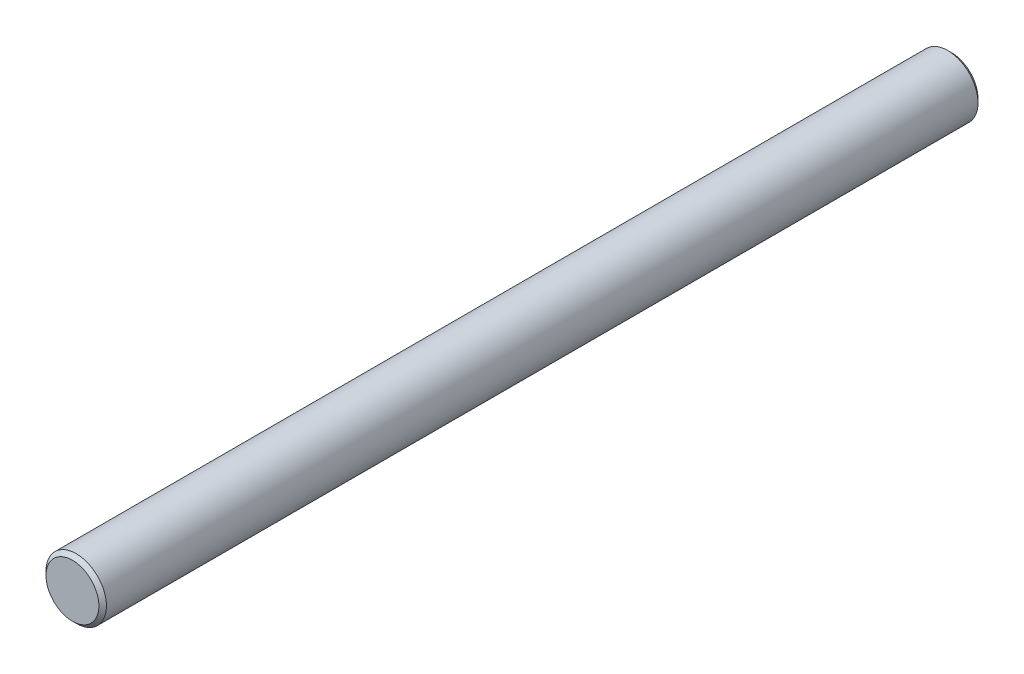
ISO-10303-21;
HEADER;
FILE_DESCRIPTION(('STEP AP214'),'2;1');
FILE_NAME('part.step','',(''),(''),'','','');
FILE_SCHEMA(('AUTOMOTIVE_DESIGN { 1 0 10303 214 1 1 1 1 }'));
ENDSEC;
DATA;
#1=APPLICATION_CONTEXT('core data for automotive mechanical design processes');
#2=APPLICATION_PROTOCOL_DEFINITION('international standard','automotive_design',2000,#1);
#3=PRODUCT_CONTEXT('',#1,'mechanical');
#4=PRODUCT('Part','Part','',(#3));
#5=PRODUCT_RELATED_PRODUCT_CATEGORY('part','',(#4));
#6=PRODUCT_DEFINITION_FORMATION('','',#4);
#7=PRODUCT_DEFINITION_CONTEXT('part definition',#1,'design');
#8=PRODUCT_DEFINITION('design','',#6,#7);
#9=PRODUCT_DEFINITION_SHAPE('','',#8);
#10=(LENGTH_UNIT() NAMED_UNIT(*) SI_UNIT(.MILLI.,.METRE.));
#11=(NAMED_UNIT(*) PLANE_ANGLE_UNIT() SI_UNIT($,.RADIAN.));
#12=(NAMED_UNIT(*) SI_UNIT($,.STERADIAN.) SOLID_ANGLE_UNIT());
#13=UNCERTAINTY_MEASURE_WITH_UNIT(LENGTH_MEASURE(1.E-05),#10,'distance_accuracy_value','');
#14=(GEOMETRIC_REPRESENTATION_CONTEXT(3) GLOBAL_UNCERTAINTY_ASSIGNED_CONTEXT((#13)) GLOBAL_UNIT_ASSIGNED_CONTEXT((#10,
#11,#12)) REPRESENTATION_CONTEXT('',''));
#15=CARTESIAN_POINT('',(0.,0.,0.));
#16=DIRECTION('',(0.,0.,1.));
#17=DIRECTION('',(1.,0.,0.));
#18=AXIS2_PLACEMENT_3D('',#15,#16,#17);
#19=CARTESIAN_POINT('',(0.,0.,119.));
#20=DIRECTION('',(0.,0.,1.));
#21=DIRECTION('',(1.,0.,0.));
#22=AXIS2_PLACEMENT_3D('',#19,#20,#21);
#23=CYLINDRICAL_SURFACE('',#22,1.);
#24=CARTESIAN_POINT('',(0.,0.,1.8267949192431));
#25=DIRECTION('',(0.,0.,1.));
#26=DIRECTION('',(1.,0.,0.));
#27=AXIS2_PLACEMENT_3D('',#24,#25,#26);
#28=CIRCLE('',#27,1.);
#29=CARTESIAN_POINT('',(1.,0.,1.8267949192431));
#30=VERTEX_POINT('',#29);
#31=EDGE_CURVE('E50',#30,#30,#28,.T.);
#32=ORIENTED_EDGE('',*,*,#31,.T.);
#33=EDGE_LOOP('',(#32));
#34=FACE_BOUND('',#33,.T.);
#35=CARTESIAN_POINT('',(0.,0.,0.299999999999981));
#36=DIRECTION('',(0.,0.,1.));
#37=DIRECTION('',(1.,0.,0.));
#38=AXIS2_PLACEMENT_3D('',#35,#36,#37);
#39=CIRCLE('',#38,1.);
#40=CARTESIAN_POINT('',(1.,0.,0.299999999999981));
#41=VERTEX_POINT('',#40);
#42=EDGE_CURVE('E53',#41,#41,#39,.F.);
#43=ORIENTED_EDGE('',*,*,#42,.T.);
#44=EDGE_LOOP('',(#43));
#45=FACE_BOUND('',#44,.T.);
#46=ADVANCED_FACE('F30',(#34,#45),#23,.F.);
#47=CARTESIAN_POINT('',(-1.,0.,0.));
#48=DIRECTION('',(0.,0.,1.));
#49=DIRECTION('',(1.,0.,0.));
#50=AXIS2_PLACEMENT_3D('',#47,#48,#49);
#51=PLANE('',#50);
#52=CARTESIAN_POINT('',(0.,0.,0.));
#53=DIRECTION('',(0.,0.,1.));
#54=DIRECTION('',(1.,0.,0.));
#55=AXIS2_PLACEMENT_3D('',#52,#53,#54);
#56=CIRCLE('',#55,1.17320508075687);
#57=CARTESIAN_POINT('',(1.17320508075687,0.,0.));
#58=VERTEX_POINT('',#57);
#59=EDGE_CURVE('E41',#58,#58,#56,.T.);
#60=ORIENTED_EDGE('',*,*,#59,.T.);
#61=EDGE_LOOP('',(#60));
#62=FACE_BOUND('',#61,.T.);
#63=CARTESIAN_POINT('',(0.,0.,0.));
#64=DIRECTION('',(0.,0.,1.));
#65=DIRECTION('',(1.,0.,0.));
#66=AXIS2_PLACEMENT_3D('',#63,#64,#65);
#67=CIRCLE('',#66,3.50000000000002);
#68=CARTESIAN_POINT('',(3.50000000000002,0.,0.));
#69=VERTEX_POINT('',#68);
#70=EDGE_CURVE('E56',#69,#69,#67,.F.);
#71=ORIENTED_EDGE('',*,*,#70,.T.);
#72=EDGE_LOOP('',(#71));
#73=FACE_BOUND('',#72,.T.);
#74=ADVANCED_FACE('F83',(#62,#73),#51,.F.);
#75=CARTESIAN_POINT('',(0.,0.,119.));
#76=DIRECTION('',(0.,0.,1.));
#77=DIRECTION('',(1.,0.,0.));
#78=AXIS2_PLACEMENT_3D('',#75,#76,#77);
#79=CYLINDRICAL_SURFACE('',#78,4.);
#80=CARTESIAN_POINT('',(0.,0.,115.85));
#81=DIRECTION('',(0.,0.,-1.));
#82=DIRECTION('',(-1.,0.,0.));
#83=AXIS2_PLACEMENT_3D('',#80,#81,#82);
#84=CIRCLE('',#83,4.);
#85=CARTESIAN_POINT('',(-3.99999999999999,0.,115.85));
#86=VERTEX_POINT('',#85);
#87=EDGE_CURVE('E37',#86,#86,#84,.T.);
#88=ORIENTED_EDGE('',*,*,#87,.T.);
#89=EDGE_LOOP('',(#88));
#90=FACE_BOUND('',#89,.T.);
#91=CARTESIAN_POINT('',(0.,0.,0.499999999999973));
#92=DIRECTION('',(0.,0.,1.));
#93=DIRECTION('',(1.,0.,0.));
#94=AXIS2_PLACEMENT_3D('',#91,#92,#93);
#95=CIRCLE('',#94,4.);
#96=CARTESIAN_POINT('',(4.,0.,0.499999999999972));
#97=VERTEX_POINT('',#96);
#98=EDGE_CURVE('E59',#97,#97,#95,.T.);
#99=ORIENTED_EDGE('',*,*,#98,.T.);
#100=EDGE_LOOP('',(#99));
#101=FACE_BOUND('',#100,.T.);
#102=ADVANCED_FACE('F63',(#90,#101),#79,.T.);
#103=CARTESIAN_POINT('',(0.,0.,2.));
#104=DIRECTION('',(0.,0.,1.));
#105=DIRECTION('',(1.,0.,0.));
#106=AXIS2_PLACEMENT_3D('',#103,#104,#105);
#107=PLANE('',#106);
#108=CARTESIAN_POINT('',(0.,0.,2.));
#109=DIRECTION('',(0.,0.,1.));
#110=DIRECTION('',(1.,0.,0.));
#111=AXIS2_PLACEMENT_3D('',#108,#109,#110);
#112=CIRCLE('',#111,0.700000000000009);
#113=CARTESIAN_POINT('',(0.700000000000009,0.,2.));
#114=VERTEX_POINT('',#113);
#115=EDGE_CURVE('E45',#114,#114,#112,.F.);
#116=ORIENTED_EDGE('',*,*,#115,.T.);
#117=EDGE_LOOP('',(#116));
#118=FACE_BOUND('',#117,.T.);
#119=ADVANCED_FACE('F68',(#118),#107,.F.);
#120=CARTESIAN_POINT('',(0.,0.,0.499999999999973));
#121=DIRECTION('',(0.,0.,1.));
#122=DIRECTION('',(1.,0.,0.));
#123=AXIS2_PLACEMENT_3D('',#120,#121,#122);
#124=CONICAL_SURFACE('',#123,4.,0.78539816339746);
#125=ORIENTED_EDGE('',*,*,#70,.F.);
#126=EDGE_LOOP('',(#125));
#127=FACE_BOUND('',#126,.T.);
#128=ORIENTED_EDGE('',*,*,#98,.F.);
#129=EDGE_LOOP('',(#128));
#130=FACE_BOUND('',#129,.T.);
#131=ADVANCED_FACE('F65',(#127,#130),#124,.T.);
#132=CARTESIAN_POINT('',(0.,0.,1.8267949192431));
#133=DIRECTION('',(0.,0.,-1.));
#134=DIRECTION('',(-1.,0.,0.));
#135=AXIS2_PLACEMENT_3D('',#132,#133,#134);
#136=CONICAL_SURFACE('',#135,1.,1.04719755119657);
#137=ORIENTED_EDGE('',*,*,#115,.F.);
#138=EDGE_LOOP('',(#137));
#139=FACE_BOUND('',#138,.T.);
#140=ORIENTED_EDGE('',*,*,#31,.F.);
#141=EDGE_LOOP('',(#140));
#142=FACE_BOUND('',#141,.T.);
#143=ADVANCED_FACE('F67',(#139,#142),#136,.F.);
#144=CARTESIAN_POINT('',(0.,0.,0.));
#145=DIRECTION('',(0.,0.,-1.));
#146=DIRECTION('',(-1.,0.,0.));
#147=AXIS2_PLACEMENT_3D('',#144,#145,#146);
#148=CONICAL_SURFACE('',#147,1.17320508075687,0.523598775598282);
#149=ORIENTED_EDGE('',*,*,#42,.F.);
#150=EDGE_LOOP('',(#149));
#151=FACE_BOUND('',#150,.T.);
#152=ORIENTED_EDGE('',*,*,#59,.F.);
#153=EDGE_LOOP('',(#152));
#154=FACE_BOUND('',#153,.T.);
#155=ADVANCED_FACE('F75',(#151,#154),#148,.F.);
#156=CARTESIAN_POINT('',(-9.05700406170683,-21.8,116.35));
#157=DIRECTION('',(0.,0.,-1.));
#158=DIRECTION('',(-1.,0.,0.));
#159=AXIS2_PLACEMENT_3D('',#156,#157,#158);
#160=PLANE('',#159);
#161=CARTESIAN_POINT('',(0.,0.,116.35));
#162=DIRECTION('',(0.,0.,-1.));
#163=DIRECTION('',(-1.,0.,0.));
#164=AXIS2_PLACEMENT_3D('',#161,#162,#163);
#165=CIRCLE('',#164,3.5);
#166=CARTESIAN_POINT('',(-3.49999999999999,0.,116.35));
#167=VERTEX_POINT('',#166);
#168=EDGE_CURVE('E10',#167,#167,#165,.F.);
#169=ORIENTED_EDGE('',*,*,#168,.T.);
#170=EDGE_LOOP('',(#169));
#171=FACE_BOUND('',#170,.T.);
#172=ADVANCED_FACE('F94',(#171),#160,.F.);
#173=CARTESIAN_POINT('',(0.,0.,115.85));
#174=DIRECTION('',(0.,0.,-1.));
#175=DIRECTION('',(-1.,0.,0.));
#176=AXIS2_PLACEMENT_3D('',#173,#174,#175);
#177=CONICAL_SURFACE('',#176,4.,0.785398163397444);
#178=ORIENTED_EDGE('',*,*,#168,.F.);
#179=EDGE_LOOP('',(#178));
#180=FACE_BOUND('',#179,.T.);
#181=ORIENTED_EDGE('',*,*,#87,.F.);
#182=EDGE_LOOP('',(#181));
#183=FACE_BOUND('',#182,.T.);
#184=ADVANCED_FACE('F32',(#180,#183),#177,.T.);
#185=CLOSED_SHELL('',(#46,#74,#102,#119,#131,#143,#155,#172,#184));
#186=MANIFOLD_SOLID_BREP('B2',#185);
#187=ADVANCED_BREP_SHAPE_REPRESENTATION('',(#18,#186),#14);
#188=SHAPE_DEFINITION_REPRESENTATION(#9,#187);
ENDSEC;
END-ISO-10303-21;
